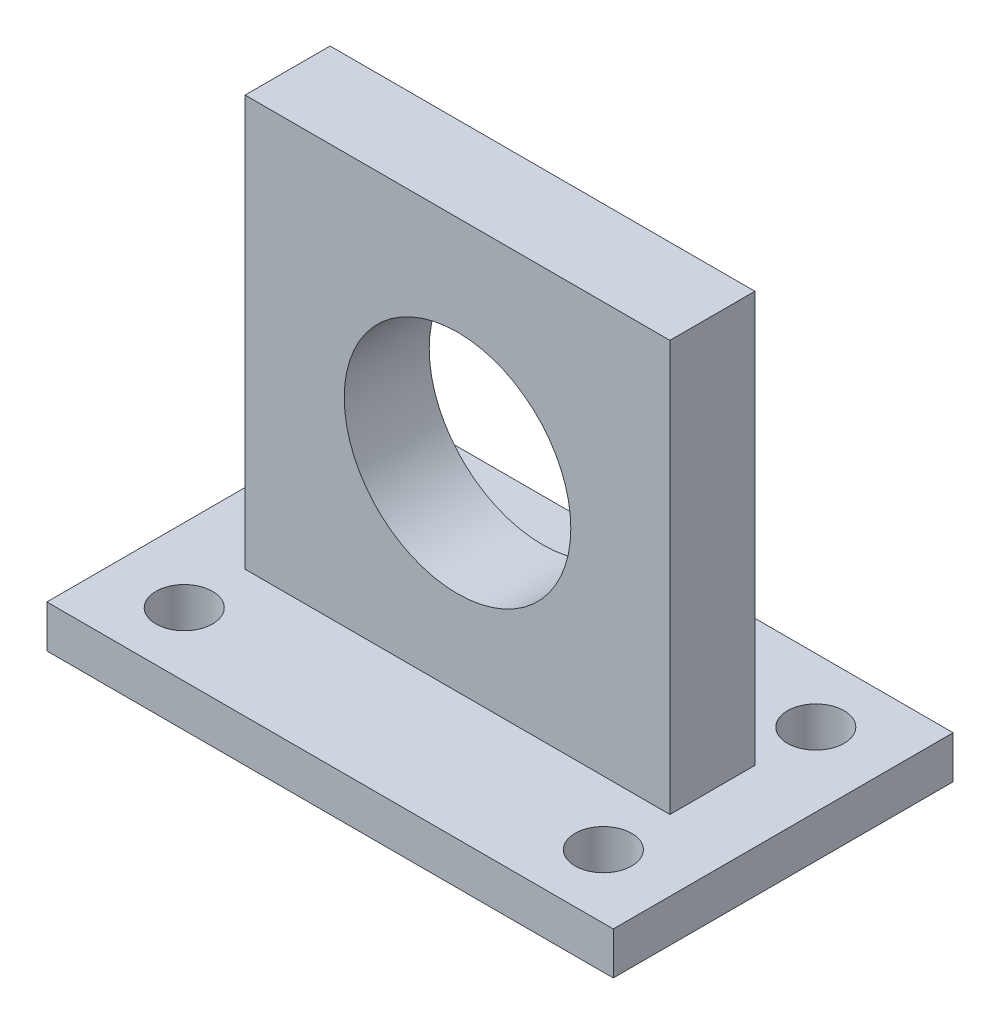
ISO-10303-21;
HEADER;
FILE_DESCRIPTION(('STEP AP214'),'2;1');
FILE_NAME('part.step','',(''),(''),'','','');
FILE_SCHEMA(('AUTOMOTIVE_DESIGN { 1 0 10303 214 1 1 1 1 }'));
ENDSEC;
DATA;
#1=APPLICATION_CONTEXT('core data for automotive mechanical design processes');
#2=APPLICATION_PROTOCOL_DEFINITION('international standard','automotive_design',2000,#1);
#3=PRODUCT_CONTEXT('',#1,'mechanical');
#4=PRODUCT('Part','Part','',(#3));
#5=PRODUCT_RELATED_PRODUCT_CATEGORY('part','',(#4));
#6=PRODUCT_DEFINITION_FORMATION('','',#4);
#7=PRODUCT_DEFINITION_CONTEXT('part definition',#1,'design');
#8=PRODUCT_DEFINITION('design','',#6,#7);
#9=PRODUCT_DEFINITION_SHAPE('','',#8);
#10=(LENGTH_UNIT() NAMED_UNIT(*) SI_UNIT(.MILLI.,.METRE.));
#11=(NAMED_UNIT(*) PLANE_ANGLE_UNIT() SI_UNIT($,.RADIAN.));
#12=(NAMED_UNIT(*) SI_UNIT($,.STERADIAN.) SOLID_ANGLE_UNIT());
#13=UNCERTAINTY_MEASURE_WITH_UNIT(LENGTH_MEASURE(1.E-05),#10,'distance_accuracy_value','');
#14=(GEOMETRIC_REPRESENTATION_CONTEXT(3) GLOBAL_UNCERTAINTY_ASSIGNED_CONTEXT((#13)) GLOBAL_UNIT_ASSIGNED_CONTEXT((#10,
#11,#12)) REPRESENTATION_CONTEXT('',''));
#15=CARTESIAN_POINT('',(0.,0.,0.));
#16=DIRECTION('',(0.,0.,1.));
#17=DIRECTION('',(1.,0.,0.));
#18=AXIS2_PLACEMENT_3D('',#15,#16,#17);
#19=CARTESIAN_POINT('',(0.,3.,0.));
#20=DIRECTION('',(0.,1.,0.));
#21=DIRECTION('',(0.,0.,1.));
#22=AXIS2_PLACEMENT_3D('',#19,#20,#21);
#23=PLANE('',#22);
#24=CARTESIAN_POINT('',(-14.8,3.,-7.5));
#25=DIRECTION('',(0.,1.,0.));
#26=DIRECTION('',(0.,0.,-1.));
#27=AXIS2_PLACEMENT_3D('',#24,#25,#26);
#28=CIRCLE('',#27,2.);
#29=CARTESIAN_POINT('',(-14.8,3.,-9.5));
#30=VERTEX_POINT('',#29);
#31=EDGE_CURVE('E166',#30,#30,#28,.T.);
#32=ORIENTED_EDGE('',*,*,#31,.F.);
#33=EDGE_LOOP('',(#32));
#34=FACE_BOUND('',#33,.T.);
#35=CARTESIAN_POINT('',(-14.8,3.,7.5));
#36=DIRECTION('',(0.,1.,0.));
#37=DIRECTION('',(0.,0.,1.));
#38=AXIS2_PLACEMENT_3D('',#35,#36,#37);
#39=CIRCLE('',#38,2.);
#40=CARTESIAN_POINT('',(-14.8,3.,9.5));
#41=VERTEX_POINT('',#40);
#42=EDGE_CURVE('E182',#41,#41,#39,.T.);
#43=ORIENTED_EDGE('',*,*,#42,.F.);
#44=EDGE_LOOP('',(#43));
#45=FACE_BOUND('',#44,.T.);
#46=DIRECTION('',(0.,0.,-1.));
#47=VECTOR('',#46,1.);
#48=CARTESIAN_POINT('',(20.,3.,-12.));
#49=LINE('',#48,#47);
#50=CARTESIAN_POINT('',(20.,3.,12.));
#51=VERTEX_POINT('',#50);
#52=CARTESIAN_POINT('',(20.,3.,-12.));
#53=VERTEX_POINT('',#52);
#54=EDGE_CURVE('E190',#51,#53,#49,.T.);
#55=ORIENTED_EDGE('',*,*,#54,.T.);
#56=DIRECTION('',(-1.,0.,0.));
#57=VECTOR('',#56,1.);
#58=CARTESIAN_POINT('',(-20.,3.,-12.));
#59=LINE('',#58,#57);
#60=CARTESIAN_POINT('',(-20.,3.,-12.));
#61=VERTEX_POINT('',#60);
#62=EDGE_CURVE('E194',#53,#61,#59,.T.);
#63=ORIENTED_EDGE('',*,*,#62,.T.);
#64=DIRECTION('',(0.,0.,1.));
#65=VECTOR('',#64,1.);
#66=CARTESIAN_POINT('',(-20.,3.,-12.));
#67=LINE('',#66,#65);
#68=CARTESIAN_POINT('',(-20.,3.,12.));
#69=VERTEX_POINT('',#68);
#70=EDGE_CURVE('E198',#61,#69,#67,.T.);
#71=ORIENTED_EDGE('',*,*,#70,.T.);
#72=DIRECTION('',(1.,0.,0.));
#73=VECTOR('',#72,1.);
#74=CARTESIAN_POINT('',(-20.,3.,12.));
#75=LINE('',#74,#73);
#76=EDGE_CURVE('E201',#69,#51,#75,.T.);
#77=ORIENTED_EDGE('',*,*,#76,.T.);
#78=EDGE_LOOP('',(#55,#63,#71,#77));
#79=FACE_BOUND('',#78,.T.);
#80=CARTESIAN_POINT('',(14.8,3.,7.5));
#81=DIRECTION('',(0.,1.,0.));
#82=DIRECTION('',(0.,0.,-1.));
#83=AXIS2_PLACEMENT_3D('',#80,#81,#82);
#84=CIRCLE('',#83,2.);
#85=CARTESIAN_POINT('',(14.8,3.,5.5));
#86=VERTEX_POINT('',#85);
#87=EDGE_CURVE('E174',#86,#86,#84,.T.);
#88=ORIENTED_EDGE('',*,*,#87,.F.);
#89=EDGE_LOOP('',(#88));
#90=FACE_BOUND('',#89,.T.);
#91=CARTESIAN_POINT('',(14.8,3.,-7.5));
#92=DIRECTION('',(0.,1.,0.));
#93=DIRECTION('',(0.,0.,1.));
#94=AXIS2_PLACEMENT_3D('',#91,#92,#93);
#95=CIRCLE('',#94,2.);
#96=CARTESIAN_POINT('',(14.8,3.,-5.5));
#97=VERTEX_POINT('',#96);
#98=EDGE_CURVE('E158',#97,#97,#95,.T.);
#99=ORIENTED_EDGE('',*,*,#98,.F.);
#100=EDGE_LOOP('',(#99));
#101=FACE_BOUND('',#100,.T.);
#102=DIRECTION('',(0.,0.,1.));
#103=VECTOR('',#102,1.);
#104=CARTESIAN_POINT('',(-15.,3.,-3.));
#105=LINE('',#104,#103);
#106=CARTESIAN_POINT('',(-15.,3.,-3.));
#107=VERTEX_POINT('',#106);
#108=CARTESIAN_POINT('',(-15.,3.,3.));
#109=VERTEX_POINT('',#108);
#110=EDGE_CURVE('E146',#107,#109,#105,.T.);
#111=ORIENTED_EDGE('',*,*,#110,.F.);
#112=DIRECTION('',(-1.,0.,0.));
#113=VECTOR('',#112,1.);
#114=CARTESIAN_POINT('',(-10.,3.,-3.));
#115=LINE('',#114,#113);
#116=CARTESIAN_POINT('',(15.,3.,-3.));
#117=VERTEX_POINT('',#116);
#118=EDGE_CURVE('E55',#117,#107,#115,.T.);
#119=ORIENTED_EDGE('',*,*,#118,.F.);
#120=DIRECTION('',(0.,0.,1.));
#121=VECTOR('',#120,1.);
#122=CARTESIAN_POINT('',(15.,3.,-3.));
#123=LINE('',#122,#121);
#124=CARTESIAN_POINT('',(15.,3.,3.));
#125=VERTEX_POINT('',#124);
#126=EDGE_CURVE('E118',#117,#125,#123,.T.);
#127=ORIENTED_EDGE('',*,*,#126,.T.);
#128=DIRECTION('',(1.,0.,0.));
#129=VECTOR('',#128,1.);
#130=CARTESIAN_POINT('',(-10.,3.,3.));
#131=LINE('',#130,#129);
#132=EDGE_CURVE('E62',#109,#125,#131,.T.);
#133=ORIENTED_EDGE('',*,*,#132,.F.);
#134=EDGE_LOOP('',(#111,#119,#127,#133));
#135=FACE_BOUND('',#134,.T.);
#136=ADVANCED_FACE('F39',(#34,#45,#79,#90,#101,#135),#23,.T.);
#137=CARTESIAN_POINT('',(0.,0.,0.));
#138=DIRECTION('',(0.,1.,0.));
#139=DIRECTION('',(0.,0.,1.));
#140=AXIS2_PLACEMENT_3D('',#137,#138,#139);
#141=PLANE('',#140);
#142=DIRECTION('',(0.,0.,-1.));
#143=VECTOR('',#142,1.);
#144=CARTESIAN_POINT('',(20.,0.,-12.));
#145=LINE('',#144,#143);
#146=CARTESIAN_POINT('',(20.,0.,12.));
#147=VERTEX_POINT('',#146);
#148=CARTESIAN_POINT('',(20.,0.,-12.));
#149=VERTEX_POINT('',#148);
#150=EDGE_CURVE('E186',#147,#149,#145,.T.);
#151=ORIENTED_EDGE('',*,*,#150,.F.);
#152=DIRECTION('',(1.,0.,0.));
#153=VECTOR('',#152,1.);
#154=CARTESIAN_POINT('',(-20.,0.,12.));
#155=LINE('',#154,#153);
#156=CARTESIAN_POINT('',(-20.,0.,12.));
#157=VERTEX_POINT('',#156);
#158=EDGE_CURVE('E195',#157,#147,#155,.T.);
#159=ORIENTED_EDGE('',*,*,#158,.F.);
#160=DIRECTION('',(0.,0.,1.));
#161=VECTOR('',#160,1.);
#162=CARTESIAN_POINT('',(-20.,0.,-12.));
#163=LINE('',#162,#161);
#164=CARTESIAN_POINT('',(-20.,0.,-12.));
#165=VERTEX_POINT('',#164);
#166=EDGE_CURVE('E211',#165,#157,#163,.T.);
#167=ORIENTED_EDGE('',*,*,#166,.F.);
#168=DIRECTION('',(-1.,0.,0.));
#169=VECTOR('',#168,1.);
#170=CARTESIAN_POINT('',(-20.,0.,-12.));
#171=LINE('',#170,#169);
#172=EDGE_CURVE('E208',#149,#165,#171,.T.);
#173=ORIENTED_EDGE('',*,*,#172,.F.);
#174=EDGE_LOOP('',(#151,#159,#167,#173));
#175=FACE_BOUND('',#174,.T.);
#176=CARTESIAN_POINT('',(-14.8,0.,7.5));
#177=DIRECTION('',(0.,1.,0.));
#178=DIRECTION('',(0.,0.,1.));
#179=AXIS2_PLACEMENT_3D('',#176,#177,#178);
#180=CIRCLE('',#179,2.);
#181=CARTESIAN_POINT('',(-14.8,0.,9.5));
#182=VERTEX_POINT('',#181);
#183=EDGE_CURVE('E178',#182,#182,#180,.T.);
#184=ORIENTED_EDGE('',*,*,#183,.T.);
#185=EDGE_LOOP('',(#184));
#186=FACE_BOUND('',#185,.T.);
#187=CARTESIAN_POINT('',(14.8,0.,7.5));
#188=DIRECTION('',(0.,1.,0.));
#189=DIRECTION('',(0.,0.,-1.));
#190=AXIS2_PLACEMENT_3D('',#187,#188,#189);
#191=CIRCLE('',#190,2.);
#192=CARTESIAN_POINT('',(14.8,0.,5.5));
#193=VERTEX_POINT('',#192);
#194=EDGE_CURVE('E170',#193,#193,#191,.T.);
#195=ORIENTED_EDGE('',*,*,#194,.T.);
#196=EDGE_LOOP('',(#195));
#197=FACE_BOUND('',#196,.T.);
#198=CARTESIAN_POINT('',(-14.8,0.,-7.5));
#199=DIRECTION('',(0.,1.,0.));
#200=DIRECTION('',(0.,0.,-1.));
#201=AXIS2_PLACEMENT_3D('',#198,#199,#200);
#202=CIRCLE('',#201,2.);
#203=CARTESIAN_POINT('',(-14.8,0.,-9.5));
#204=VERTEX_POINT('',#203);
#205=EDGE_CURVE('E162',#204,#204,#202,.T.);
#206=ORIENTED_EDGE('',*,*,#205,.T.);
#207=EDGE_LOOP('',(#206));
#208=FACE_BOUND('',#207,.T.);
#209=CARTESIAN_POINT('',(14.8,0.,-7.5));
#210=DIRECTION('',(0.,1.,0.));
#211=DIRECTION('',(0.,0.,1.));
#212=AXIS2_PLACEMENT_3D('',#209,#210,#211);
#213=CIRCLE('',#212,2.);
#214=CARTESIAN_POINT('',(14.8,0.,-5.5));
#215=VERTEX_POINT('',#214);
#216=EDGE_CURVE('E157',#215,#215,#213,.T.);
#217=ORIENTED_EDGE('',*,*,#216,.T.);
#218=EDGE_LOOP('',(#217));
#219=FACE_BOUND('',#218,.T.);
#220=ADVANCED_FACE('F234',(#175,#186,#197,#208,#219),#141,.F.);
#221=CARTESIAN_POINT('',(20.,3.,-12.));
#222=DIRECTION('',(-1.,0.,0.));
#223=DIRECTION('',(0.,0.,1.));
#224=AXIS2_PLACEMENT_3D('',#221,#222,#223);
#225=PLANE('',#224);
#226=ORIENTED_EDGE('',*,*,#150,.T.);
#227=DIRECTION('',(0.,-1.,0.));
#228=VECTOR('',#227,1.);
#229=CARTESIAN_POINT('',(20.,3.,-12.));
#230=LINE('',#229,#228);
#231=EDGE_CURVE('E11',#53,#149,#230,.T.);
#232=ORIENTED_EDGE('',*,*,#231,.F.);
#233=ORIENTED_EDGE('',*,*,#54,.F.);
#234=DIRECTION('',(0.,-1.,0.));
#235=VECTOR('',#234,1.);
#236=CARTESIAN_POINT('',(20.,3.,12.));
#237=LINE('',#236,#235);
#238=EDGE_CURVE('E204',#51,#147,#237,.T.);
#239=ORIENTED_EDGE('',*,*,#238,.T.);
#240=EDGE_LOOP('',(#226,#232,#233,#239));
#241=FACE_BOUND('',#240,.T.);
#242=ADVANCED_FACE('F41',(#241),#225,.F.);
#243=CARTESIAN_POINT('',(-20.,3.,-12.));
#244=DIRECTION('',(0.,0.,1.));
#245=DIRECTION('',(1.,0.,0.));
#246=AXIS2_PLACEMENT_3D('',#243,#244,#245);
#247=PLANE('',#246);
#248=ORIENTED_EDGE('',*,*,#172,.T.);
#249=DIRECTION('',(0.,-1.,0.));
#250=VECTOR('',#249,1.);
#251=CARTESIAN_POINT('',(-20.,3.,-12.));
#252=LINE('',#251,#250);
#253=EDGE_CURVE('E48',#61,#165,#252,.T.);
#254=ORIENTED_EDGE('',*,*,#253,.F.);
#255=ORIENTED_EDGE('',*,*,#62,.F.);
#256=ORIENTED_EDGE('',*,*,#231,.T.);
#257=EDGE_LOOP('',(#248,#254,#255,#256));
#258=FACE_BOUND('',#257,.T.);
#259=ADVANCED_FACE('F245',(#258),#247,.F.);
#260=CARTESIAN_POINT('',(-20.,3.,-12.));
#261=DIRECTION('',(1.,0.,0.));
#262=DIRECTION('',(0.,0.,-1.));
#263=AXIS2_PLACEMENT_3D('',#260,#261,#262);
#264=PLANE('',#263);
#265=ORIENTED_EDGE('',*,*,#166,.T.);
#266=DIRECTION('',(0.,-1.,0.));
#267=VECTOR('',#266,1.);
#268=CARTESIAN_POINT('',(-20.,3.,12.));
#269=LINE('',#268,#267);
#270=EDGE_CURVE('E219',#69,#157,#269,.T.);
#271=ORIENTED_EDGE('',*,*,#270,.F.);
#272=ORIENTED_EDGE('',*,*,#70,.F.);
#273=ORIENTED_EDGE('',*,*,#253,.T.);
#274=EDGE_LOOP('',(#265,#271,#272,#273));
#275=FACE_BOUND('',#274,.T.);
#276=ADVANCED_FACE('F228',(#275),#264,.F.);
#277=CARTESIAN_POINT('',(-20.,3.,12.));
#278=DIRECTION('',(0.,0.,-1.));
#279=DIRECTION('',(-1.,0.,0.));
#280=AXIS2_PLACEMENT_3D('',#277,#278,#279);
#281=PLANE('',#280);
#282=ORIENTED_EDGE('',*,*,#158,.T.);
#283=ORIENTED_EDGE('',*,*,#238,.F.);
#284=ORIENTED_EDGE('',*,*,#76,.F.);
#285=ORIENTED_EDGE('',*,*,#270,.T.);
#286=EDGE_LOOP('',(#282,#283,#284,#285));
#287=FACE_BOUND('',#286,.T.);
#288=ADVANCED_FACE('F238',(#287),#281,.F.);
#289=CARTESIAN_POINT('',(-14.8,3.,7.5));
#290=DIRECTION('',(0.,-1.,0.));
#291=DIRECTION('',(0.,0.,-1.));
#292=AXIS2_PLACEMENT_3D('',#289,#290,#291);
#293=CYLINDRICAL_SURFACE('',#292,2.);
#294=ORIENTED_EDGE('',*,*,#42,.T.);
#295=EDGE_LOOP('',(#294));
#296=FACE_BOUND('',#295,.T.);
#297=ORIENTED_EDGE('',*,*,#183,.F.);
#298=EDGE_LOOP('',(#297));
#299=FACE_BOUND('',#298,.T.);
#300=ADVANCED_FACE('F262',(#296,#299),#293,.F.);
#301=CARTESIAN_POINT('',(14.8,3.,7.5));
#302=DIRECTION('',(0.,-1.,0.));
#303=DIRECTION('',(0.,0.,-1.));
#304=AXIS2_PLACEMENT_3D('',#301,#302,#303);
#305=CYLINDRICAL_SURFACE('',#304,2.);
#306=ORIENTED_EDGE('',*,*,#87,.T.);
#307=EDGE_LOOP('',(#306));
#308=FACE_BOUND('',#307,.T.);
#309=ORIENTED_EDGE('',*,*,#194,.F.);
#310=EDGE_LOOP('',(#309));
#311=FACE_BOUND('',#310,.T.);
#312=ADVANCED_FACE('F269',(#308,#311),#305,.F.);
#313=CARTESIAN_POINT('',(-14.8,3.,-7.5));
#314=DIRECTION('',(0.,-1.,0.));
#315=DIRECTION('',(0.,0.,-1.));
#316=AXIS2_PLACEMENT_3D('',#313,#314,#315);
#317=CYLINDRICAL_SURFACE('',#316,2.);
#318=ORIENTED_EDGE('',*,*,#31,.T.);
#319=EDGE_LOOP('',(#318));
#320=FACE_BOUND('',#319,.T.);
#321=ORIENTED_EDGE('',*,*,#205,.F.);
#322=EDGE_LOOP('',(#321));
#323=FACE_BOUND('',#322,.T.);
#324=ADVANCED_FACE('F274',(#320,#323),#317,.F.);
#325=CARTESIAN_POINT('',(14.8,3.,-7.5));
#326=DIRECTION('',(0.,-1.,0.));
#327=DIRECTION('',(0.,0.,-1.));
#328=AXIS2_PLACEMENT_3D('',#325,#326,#327);
#329=CYLINDRICAL_SURFACE('',#328,2.);
#330=ORIENTED_EDGE('',*,*,#98,.T.);
#331=EDGE_LOOP('',(#330));
#332=FACE_BOUND('',#331,.T.);
#333=ORIENTED_EDGE('',*,*,#216,.F.);
#334=EDGE_LOOP('',(#333));
#335=FACE_BOUND('',#334,.T.);
#336=ADVANCED_FACE('F286',(#332,#335),#329,.F.);
#337=CARTESIAN_POINT('',(-10.,28.,-3.));
#338=DIRECTION('',(0.,0.,1.));
#339=DIRECTION('',(1.,0.,0.));
#340=AXIS2_PLACEMENT_3D('',#337,#338,#339);
#341=PLANE('',#340);
#342=CARTESIAN_POINT('',(0.,17.,-3.));
#343=DIRECTION('',(0.,0.,1.));
#344=DIRECTION('',(1.,0.,0.));
#345=AXIS2_PLACEMENT_3D('',#342,#343,#344);
#346=CIRCLE('',#345,8.);
#347=CARTESIAN_POINT('',(8.,17.,-3.));
#348=VERTEX_POINT('',#347);
#349=EDGE_CURVE('E143',#348,#348,#346,.T.);
#350=ORIENTED_EDGE('',*,*,#349,.T.);
#351=EDGE_LOOP('',(#350));
#352=FACE_BOUND('',#351,.T.);
#353=ORIENTED_EDGE('',*,*,#118,.T.);
#354=DIRECTION('',(0.,-1.,0.));
#355=VECTOR('',#354,1.);
#356=CARTESIAN_POINT('',(-15.,32.,-3.));
#357=LINE('',#356,#355);
#358=CARTESIAN_POINT('',(-15.,32.,-3.));
#359=VERTEX_POINT('',#358);
#360=EDGE_CURVE('E123',#359,#107,#357,.T.);
#361=ORIENTED_EDGE('',*,*,#360,.F.);
#362=DIRECTION('',(-1.,0.,0.));
#363=VECTOR('',#362,1.);
#364=CARTESIAN_POINT('',(-15.,32.,-3.));
#365=LINE('',#364,#363);
#366=CARTESIAN_POINT('',(15.,32.,-3.));
#367=VERTEX_POINT('',#366);
#368=EDGE_CURVE('E109',#367,#359,#365,.T.);
#369=ORIENTED_EDGE('',*,*,#368,.F.);
#370=DIRECTION('',(0.,1.,0.));
#371=VECTOR('',#370,1.);
#372=CARTESIAN_POINT('',(15.,32.,-3.));
#373=LINE('',#372,#371);
#374=EDGE_CURVE('E121',#117,#367,#373,.T.);
#375=ORIENTED_EDGE('',*,*,#374,.F.);
#376=EDGE_LOOP('',(#353,#361,#369,#375));
#377=FACE_BOUND('',#376,.T.);
#378=ADVANCED_FACE('F120',(#352,#377),#341,.F.);
#379=CARTESIAN_POINT('',(-10.,28.,3.));
#380=DIRECTION('',(0.,0.,-1.));
#381=DIRECTION('',(-1.,0.,0.));
#382=AXIS2_PLACEMENT_3D('',#379,#380,#381);
#383=PLANE('',#382);
#384=CARTESIAN_POINT('',(0.,17.,3.));
#385=DIRECTION('',(0.,0.,1.));
#386=DIRECTION('',(1.,0.,0.));
#387=AXIS2_PLACEMENT_3D('',#384,#385,#386);
#388=CIRCLE('',#387,8.);
#389=CARTESIAN_POINT('',(8.,17.,3.));
#390=VERTEX_POINT('',#389);
#391=EDGE_CURVE('E135',#390,#390,#388,.T.);
#392=ORIENTED_EDGE('',*,*,#391,.F.);
#393=EDGE_LOOP('',(#392));
#394=FACE_BOUND('',#393,.T.);
#395=DIRECTION('',(0.,-1.,0.));
#396=VECTOR('',#395,1.);
#397=CARTESIAN_POINT('',(-15.,32.,3.));
#398=LINE('',#397,#396);
#399=CARTESIAN_POINT('',(-15.,32.,3.));
#400=VERTEX_POINT('',#399);
#401=EDGE_CURVE('E129',#400,#109,#398,.T.);
#402=ORIENTED_EDGE('',*,*,#401,.T.);
#403=ORIENTED_EDGE('',*,*,#132,.T.);
#404=DIRECTION('',(0.,1.,0.));
#405=VECTOR('',#404,1.);
#406=CARTESIAN_POINT('',(15.,32.,3.));
#407=LINE('',#406,#405);
#408=CARTESIAN_POINT('',(15.,32.,3.));
#409=VERTEX_POINT('',#408);
#410=EDGE_CURVE('E140',#125,#409,#407,.T.);
#411=ORIENTED_EDGE('',*,*,#410,.T.);
#412=DIRECTION('',(-1.,0.,0.));
#413=VECTOR('',#412,1.);
#414=CARTESIAN_POINT('',(-15.,32.,3.));
#415=LINE('',#414,#413);
#416=EDGE_CURVE('E111',#409,#400,#415,.T.);
#417=ORIENTED_EDGE('',*,*,#416,.T.);
#418=EDGE_LOOP('',(#402,#403,#411,#417));
#419=FACE_BOUND('',#418,.T.);
#420=ADVANCED_FACE('F294',(#394,#419),#383,.F.);
#421=CARTESIAN_POINT('',(-15.,32.,-3.));
#422=DIRECTION('',(-1.,0.,0.));
#423=DIRECTION('',(0.,0.,1.));
#424=AXIS2_PLACEMENT_3D('',#421,#422,#423);
#425=PLANE('',#424);
#426=ORIENTED_EDGE('',*,*,#401,.F.);
#427=DIRECTION('',(0.,0.,1.));
#428=VECTOR('',#427,1.);
#429=CARTESIAN_POINT('',(-15.,32.,-3.));
#430=LINE('',#429,#428);
#431=EDGE_CURVE('E117',#359,#400,#430,.T.);
#432=ORIENTED_EDGE('',*,*,#431,.F.);
#433=ORIENTED_EDGE('',*,*,#360,.T.);
#434=ORIENTED_EDGE('',*,*,#110,.T.);
#435=EDGE_LOOP('',(#426,#432,#433,#434));
#436=FACE_BOUND('',#435,.T.);
#437=ADVANCED_FACE('F302',(#436),#425,.T.);
#438=CARTESIAN_POINT('',(-15.,32.,-3.));
#439=DIRECTION('',(0.,1.,0.));
#440=DIRECTION('',(-1.,0.,0.));
#441=AXIS2_PLACEMENT_3D('',#438,#439,#440);
#442=PLANE('',#441);
#443=ORIENTED_EDGE('',*,*,#416,.F.);
#444=DIRECTION('',(0.,0.,1.));
#445=VECTOR('',#444,1.);
#446=CARTESIAN_POINT('',(15.,32.,-3.));
#447=LINE('',#446,#445);
#448=EDGE_CURVE('E106',#367,#409,#447,.T.);
#449=ORIENTED_EDGE('',*,*,#448,.F.);
#450=ORIENTED_EDGE('',*,*,#368,.T.);
#451=ORIENTED_EDGE('',*,*,#431,.T.);
#452=EDGE_LOOP('',(#443,#449,#450,#451));
#453=FACE_BOUND('',#452,.T.);
#454=ADVANCED_FACE('F108',(#453),#442,.T.);
#455=CARTESIAN_POINT('',(15.,32.,-3.));
#456=DIRECTION('',(1.,0.,0.));
#457=DIRECTION('',(0.,0.,-1.));
#458=AXIS2_PLACEMENT_3D('',#455,#456,#457);
#459=PLANE('',#458);
#460=ORIENTED_EDGE('',*,*,#410,.F.);
#461=ORIENTED_EDGE('',*,*,#126,.F.);
#462=ORIENTED_EDGE('',*,*,#374,.T.);
#463=ORIENTED_EDGE('',*,*,#448,.T.);
#464=EDGE_LOOP('',(#460,#461,#462,#463));
#465=FACE_BOUND('',#464,.T.);
#466=ADVANCED_FACE('F127',(#465),#459,.T.);
#467=CARTESIAN_POINT('',(0.,17.,-3.));
#468=DIRECTION('',(0.,0.,1.));
#469=DIRECTION('',(1.,0.,0.));
#470=AXIS2_PLACEMENT_3D('',#467,#468,#469);
#471=CYLINDRICAL_SURFACE('',#470,8.);
#472=ORIENTED_EDGE('',*,*,#349,.F.);
#473=EDGE_LOOP('',(#472));
#474=FACE_BOUND('',#473,.T.);
#475=ORIENTED_EDGE('',*,*,#391,.T.);
#476=EDGE_LOOP('',(#475));
#477=FACE_BOUND('',#476,.T.);
#478=ADVANCED_FACE('F306',(#474,#477),#471,.F.);
#479=CLOSED_SHELL('',(#136,#220,#242,#259,#276,#288,#300,#312,#324,#336,#378,#420,#437,#454,
#466,#478));
#480=MANIFOLD_SOLID_BREP('B2',#479);
#481=ADVANCED_BREP_SHAPE_REPRESENTATION('',(#18,#480),#14);
#482=SHAPE_DEFINITION_REPRESENTATION(#9,#481);
ENDSEC;
END-ISO-10303-21;
